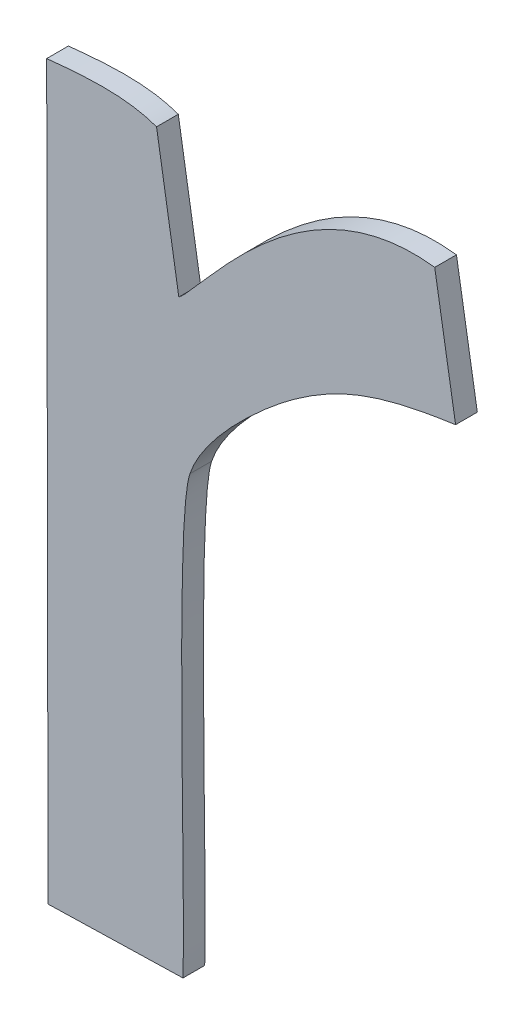
ISO-10303-21;
HEADER;
FILE_DESCRIPTION(('STEP AP214'),'2;1');
FILE_NAME('part.step','',(''),(''),'','','');
FILE_SCHEMA(('AUTOMOTIVE_DESIGN { 1 0 10303 214 1 1 1 1 }'));
ENDSEC;
DATA;
#1=APPLICATION_CONTEXT('core data for automotive mechanical design processes');
#2=APPLICATION_PROTOCOL_DEFINITION('international standard','automotive_design',2000,#1);
#3=PRODUCT_CONTEXT('',#1,'mechanical');
#4=PRODUCT('Part','Part','',(#3));
#5=PRODUCT_RELATED_PRODUCT_CATEGORY('part','',(#4));
#6=PRODUCT_DEFINITION_FORMATION('','',#4);
#7=PRODUCT_DEFINITION_CONTEXT('part definition',#1,'design');
#8=PRODUCT_DEFINITION('design','',#6,#7);
#9=PRODUCT_DEFINITION_SHAPE('','',#8);
#10=(LENGTH_UNIT() NAMED_UNIT(*) SI_UNIT(.MILLI.,.METRE.));
#11=(NAMED_UNIT(*) PLANE_ANGLE_UNIT() SI_UNIT($,.RADIAN.));
#12=(NAMED_UNIT(*) SI_UNIT($,.STERADIAN.) SOLID_ANGLE_UNIT());
#13=UNCERTAINTY_MEASURE_WITH_UNIT(LENGTH_MEASURE(1.E-05),#10,'distance_accuracy_value','');
#14=(GEOMETRIC_REPRESENTATION_CONTEXT(3) GLOBAL_UNCERTAINTY_ASSIGNED_CONTEXT((#13)) GLOBAL_UNIT_ASSIGNED_CONTEXT((#10,
#11,#12)) REPRESENTATION_CONTEXT('',''));
#15=CARTESIAN_POINT('',(0.,0.,0.));
#16=DIRECTION('',(0.,0.,1.));
#17=DIRECTION('',(1.,0.,0.));
#18=AXIS2_PLACEMENT_3D('',#15,#16,#17);
#19=CARTESIAN_POINT('',(-9.5159382007321,-1.5536225633814,0.001));
#20=DIRECTION('',(-0.986932880775738,-0.161131898901808,0.));
#21=DIRECTION('',(0.161131898901808,-0.986932880775738,0.));
#22=AXIS2_PLACEMENT_3D('',#19,#20,#21);
#23=PLANE('',#22);
#24=DIRECTION('',(-0.161131898901808,0.986932880775738,0.));
#25=VECTOR('',#24,1.);
#26=CARTESIAN_POINT('',(-9.5159382007321,-1.5536225633814,0.));
#27=LINE('',#26,#25);
#28=CARTESIAN_POINT('',(-1.83305765625,-48.6112658984375,0.));
#29=VERTEX_POINT('',#28);
#30=CARTESIAN_POINT('',(-1.83408140625,-48.6049954296875,0.));
#31=VERTEX_POINT('',#30);
#32=EDGE_CURVE('E11',#29,#31,#27,.T.);
#33=ORIENTED_EDGE('',*,*,#32,.T.);
#34=DIRECTION('',(0.,0.,-1.));
#35=VECTOR('',#34,1.);
#36=CARTESIAN_POINT('',(-1.83408140625,-48.6049954296875,0.001));
#37=LINE('',#36,#35);
#38=CARTESIAN_POINT('',(-1.83408140625,-48.6049954296875,0.001));
#39=VERTEX_POINT('',#38);
#40=EDGE_CURVE('E24',#39,#31,#37,.T.);
#41=ORIENTED_EDGE('',*,*,#40,.F.);
#42=DIRECTION('',(-0.161131898901808,0.986932880775738,0.));
#43=VECTOR('',#42,1.);
#44=CARTESIAN_POINT('',(-9.5159382007321,-1.5536225633814,0.001));
#45=LINE('',#44,#43);
#46=CARTESIAN_POINT('',(-1.83305765625,-48.6112658984375,0.001));
#47=VERTEX_POINT('',#46);
#48=EDGE_CURVE('E205',#47,#39,#45,.T.);
#49=ORIENTED_EDGE('',*,*,#48,.F.);
#50=DIRECTION('',(0.,0.,-1.));
#51=VECTOR('',#50,1.);
#52=CARTESIAN_POINT('',(-1.83305765625,-48.6112658984375,0.001));
#53=LINE('',#52,#51);
#54=EDGE_CURVE('E106',#47,#29,#53,.T.);
#55=ORIENTED_EDGE('',*,*,#54,.T.);
#56=EDGE_LOOP('',(#33,#41,#49,#55));
#57=FACE_BOUND('',#56,.T.);
#58=ADVANCED_FACE('F17',(#57),#23,.F.);
#59=CARTESIAN_POINT('',(-1.83408140625,-48.6049954296875,0.001));
#60=CARTESIAN_POINT('',(-1.83408140625,-48.6049954296875,0.));
#61=CARTESIAN_POINT('',(-1.835553046875,-48.6044515625,0.001));
#62=CARTESIAN_POINT('',(-1.835553046875,-48.6044515625,0.));
#63=CARTESIAN_POINT('',(-1.8375365625,-48.604643515625,0.001));
#64=CARTESIAN_POINT('',(-1.8375365625,-48.604643515625,0.));
#65=CARTESIAN_POINT('',(-1.839136171875,-48.6048034765625,0.001));
#66=CARTESIAN_POINT('',(-1.839136171875,-48.6048034765625,0.));
#67=B_SPLINE_SURFACE_WITH_KNOTS('',3,1,((#59,#60),(#61,#62),(#63,#64),(#65,#66)),.UNSPECIFIED.,
.F.,.F.,.F.,(4,4),(2,2),(0.6,0.7),(0.,1.),.UNSPECIFIED.);
#68=CARTESIAN_POINT('',(-1.83408140625,-48.6049954296875,0.));
#69=CARTESIAN_POINT('',(-1.835553046875,-48.6044515625,0.));
#70=CARTESIAN_POINT('',(-1.8375365625,-48.604643515625,0.));
#71=CARTESIAN_POINT('',(-1.839136171875,-48.6048034765625,0.));
#72=B_SPLINE_CURVE_WITH_KNOTS('',3,(#68,#69,#70,#71),.UNSPECIFIED.,.F.,.F.,(4,4),(0.6,0.7),.UNSPECIFIED.);
#73=CARTESIAN_POINT('',(-1.839136171875,-48.6048034765625,0.));
#74=VERTEX_POINT('',#73);
#75=EDGE_CURVE('E196',#31,#74,#72,.T.);
#76=DIRECTION('',(0.,0.,-1.));
#77=VECTOR('',#76,1.);
#78=CARTESIAN_POINT('',(-1.839136171875,-48.6048034765625,0.001));
#79=LINE('',#78,#77);
#80=CARTESIAN_POINT('',(-1.839136171875,-48.6048034765625,0.001));
#81=VERTEX_POINT('',#80);
#82=EDGE_CURVE('E191',#81,#74,#79,.T.);
#83=CARTESIAN_POINT('',(-1.83408140625,-48.6049954296875,0.001));
#84=CARTESIAN_POINT('',(-1.835553046875,-48.6044515625,0.001));
#85=CARTESIAN_POINT('',(-1.8375365625,-48.604643515625,0.001));
#86=CARTESIAN_POINT('',(-1.839136171875,-48.6048034765625,0.001));
#87=B_SPLINE_CURVE_WITH_KNOTS('',3,(#83,#84,#85,#86),.UNSPECIFIED.,.F.,.F.,(4,4),(0.6,0.7),.UNSPECIFIED.);
#88=EDGE_CURVE('E187',#39,#81,#87,.T.);
#89=ORIENTED_EDGE('',*,*,#75,.T.);
#90=ORIENTED_EDGE('',*,*,#82,.F.);
#91=ORIENTED_EDGE('',*,*,#88,.F.);
#92=ORIENTED_EDGE('',*,*,#40,.T.);
#93=EDGE_LOOP('',(#89,#90,#91,#92));
#94=FACE_BOUND('',#93,.T.);
#95=ADVANCED_FACE('F208',(#94),#67,.F.);
#96=CARTESIAN_POINT('',(-1.9315337600102,-0.00367211741446376,0.001));
#97=DIRECTION('',(0.999998192836948,0.0019011372487373,0.));
#98=DIRECTION('',(-0.0019011372487373,0.999998192836948,0.));
#99=AXIS2_PLACEMENT_3D('',#96,#97,#98);
#100=PLANE('',#99);
#101=DIRECTION('',(0.0019011372487373,-0.999998192836948,0.));
#102=VECTOR('',#101,1.);
#103=CARTESIAN_POINT('',(-1.9315337600102,-0.00367211741446376,0.));
#104=LINE('',#103,#102);
#105=CARTESIAN_POINT('',(-1.8390721875,-48.6384592578125,0.));
#106=VERTEX_POINT('',#105);
#107=EDGE_CURVE('E185',#74,#106,#104,.T.);
#108=ORIENTED_EDGE('',*,*,#107,.T.);
#109=DIRECTION('',(0.,0.,-1.));
#110=VECTOR('',#109,1.);
#111=CARTESIAN_POINT('',(-1.8390721875,-48.6384592578125,0.001));
#112=LINE('',#111,#110);
#113=CARTESIAN_POINT('',(-1.8390721875,-48.6384592578125,0.001));
#114=VERTEX_POINT('',#113);
#115=EDGE_CURVE('E182',#114,#106,#112,.T.);
#116=ORIENTED_EDGE('',*,*,#115,.F.);
#117=DIRECTION('',(0.0019011372487373,-0.999998192836948,0.));
#118=VECTOR('',#117,1.);
#119=CARTESIAN_POINT('',(-1.9315337600102,-0.00367211741446376,0.001));
#120=LINE('',#119,#118);
#121=EDGE_CURVE('E179',#81,#114,#120,.T.);
#122=ORIENTED_EDGE('',*,*,#121,.F.);
#123=ORIENTED_EDGE('',*,*,#82,.T.);
#124=EDGE_LOOP('',(#108,#116,#122,#123));
#125=FACE_BOUND('',#124,.T.);
#126=ADVANCED_FACE('F215',(#125),#100,.F.);
#127=CARTESIAN_POINT('',(1.2515155910401,-48.5588049336254,0.001));
#128=DIRECTION('',(-0.0257646401168516,0.999668036559962,0.));
#129=DIRECTION('',(-0.999668036559962,-0.0257646401168516,0.));
#130=AXIS2_PLACEMENT_3D('',#127,#128,#129);
#131=PLANE('',#130);
#132=DIRECTION('',(0.999668036559962,0.0257646401168516,0.));
#133=VECTOR('',#132,1.);
#134=CARTESIAN_POINT('',(1.2515155910401,-48.5588049336254,0.));
#135=LINE('',#134,#133);
#136=CARTESIAN_POINT('',(-1.832865703125,-48.638299296875,0.));
#137=VERTEX_POINT('',#136);
#138=EDGE_CURVE('E177',#106,#137,#135,.T.);
#139=ORIENTED_EDGE('',*,*,#138,.T.);
#140=DIRECTION('',(0.,0.,-1.));
#141=VECTOR('',#140,1.);
#142=CARTESIAN_POINT('',(-1.832865703125,-48.638299296875,0.001));
#143=LINE('',#142,#141);
#144=CARTESIAN_POINT('',(-1.832865703125,-48.638299296875,0.001));
#145=VERTEX_POINT('',#144);
#146=EDGE_CURVE('E174',#145,#137,#143,.T.);
#147=ORIENTED_EDGE('',*,*,#146,.F.);
#148=DIRECTION('',(0.999668036559962,0.0257646401168516,0.));
#149=VECTOR('',#148,1.);
#150=CARTESIAN_POINT('',(1.2515155910401,-48.5588049336254,0.001));
#151=LINE('',#150,#149);
#152=EDGE_CURVE('E168',#114,#145,#151,.T.);
#153=ORIENTED_EDGE('',*,*,#152,.F.);
#154=ORIENTED_EDGE('',*,*,#115,.T.);
#155=EDGE_LOOP('',(#139,#147,#153,#154));
#156=FACE_BOUND('',#155,.T.);
#157=ADVANCED_FACE('F219',(#156),#131,.F.);
#158=CARTESIAN_POINT('',(-1.832865703125,-48.638299296875,0.001));
#159=CARTESIAN_POINT('',(-1.832865703125,-48.638299296875,0.));
#160=CARTESIAN_POINT('',(-1.832737734375,-48.634844140625,0.001));
#161=CARTESIAN_POINT('',(-1.832737734375,-48.634844140625,0.));
#162=CARTESIAN_POINT('',(-1.833249609375,-48.6200317578125,0.001));
#163=CARTESIAN_POINT('',(-1.833249609375,-48.6200317578125,0.));
#164=CARTESIAN_POINT('',(-1.83254578125,-48.6180482421875,0.001));
#165=CARTESIAN_POINT('',(-1.83254578125,-48.6180482421875,0.));
#166=B_SPLINE_SURFACE_WITH_KNOTS('',3,1,((#158,#159),(#160,#161),(#162,#163),(#164,#165)),
.UNSPECIFIED.,.F.,.F.,.F.,(4,4),(2,2),(0.,0.1),(0.,1.),.UNSPECIFIED.);
#167=CARTESIAN_POINT('',(-1.832865703125,-48.638299296875,0.));
#168=CARTESIAN_POINT('',(-1.832737734375,-48.634844140625,0.));
#169=CARTESIAN_POINT('',(-1.833249609375,-48.6200317578125,0.));
#170=CARTESIAN_POINT('',(-1.83254578125,-48.6180482421875,0.));
#171=B_SPLINE_CURVE_WITH_KNOTS('',3,(#167,#168,#169,#170),.UNSPECIFIED.,.F.,.F.,(4,4),(0.,0.1),.UNSPECIFIED.);
#172=CARTESIAN_POINT('',(-1.83254578125,-48.6180482421875,0.));
#173=VERTEX_POINT('',#172);
#174=EDGE_CURVE('E163',#137,#173,#171,.T.);
#175=DIRECTION('',(0.,0.,-1.));
#176=VECTOR('',#175,1.);
#177=CARTESIAN_POINT('',(-1.83254578125,-48.6180482421875,0.001));
#178=LINE('',#177,#176);
#179=CARTESIAN_POINT('',(-1.83254578125,-48.6180482421875,0.001));
#180=VERTEX_POINT('',#179);
#181=EDGE_CURVE('E158',#180,#173,#178,.T.);
#182=CARTESIAN_POINT('',(-1.832865703125,-48.638299296875,0.001));
#183=CARTESIAN_POINT('',(-1.832737734375,-48.634844140625,0.001));
#184=CARTESIAN_POINT('',(-1.833249609375,-48.6200317578125,0.001));
#185=CARTESIAN_POINT('',(-1.83254578125,-48.6180482421875,0.001));
#186=B_SPLINE_CURVE_WITH_KNOTS('',3,(#182,#183,#184,#185),.UNSPECIFIED.,.F.,.F.,(4,4),(0.,0.1),.UNSPECIFIED.);
#187=EDGE_CURVE('E151',#145,#180,#186,.T.);
#188=ORIENTED_EDGE('',*,*,#174,.T.);
#189=ORIENTED_EDGE('',*,*,#181,.F.);
#190=ORIENTED_EDGE('',*,*,#187,.F.);
#191=ORIENTED_EDGE('',*,*,#146,.T.);
#192=EDGE_LOOP('',(#188,#189,#190,#191));
#193=FACE_BOUND('',#192,.T.);
#194=ADVANCED_FACE('F223',(#193),#166,.F.);
#195=CARTESIAN_POINT('',(-1.83254578125,-48.6180482421875,0.001));
#196=CARTESIAN_POINT('',(-1.83254578125,-48.6180482421875,0.));
#197=CARTESIAN_POINT('',(-1.8319059375,-48.6161287109375,0.001));
#198=CARTESIAN_POINT('',(-1.8319059375,-48.6161287109375,0.));
#199=CARTESIAN_POINT('',(-1.829154609375,-48.6136973046875,0.001));
#200=CARTESIAN_POINT('',(-1.829154609375,-48.6136973046875,0.));
#201=CARTESIAN_POINT('',(-1.8277789453125,-48.612705546875,0.001));
#202=CARTESIAN_POINT('',(-1.8277789453125,-48.612705546875,0.));
#203=B_SPLINE_SURFACE_WITH_KNOTS('',3,1,((#195,#196),(#197,#198),(#199,#200),(#201,#202)),
.UNSPECIFIED.,.F.,.F.,.F.,(4,4),(2,2),(0.1,0.2),(0.,1.),.UNSPECIFIED.);
#204=CARTESIAN_POINT('',(-1.83254578125,-48.6180482421875,0.));
#205=CARTESIAN_POINT('',(-1.8319059375,-48.6161287109375,0.));
#206=CARTESIAN_POINT('',(-1.829154609375,-48.6136973046875,0.));
#207=CARTESIAN_POINT('',(-1.8277789453125,-48.612705546875,0.));
#208=B_SPLINE_CURVE_WITH_KNOTS('',3,(#204,#205,#206,#207),.UNSPECIFIED.,.F.,.F.,(4,4),(0.1,0.2),.UNSPECIFIED.);
#209=CARTESIAN_POINT('',(-1.8277789453125,-48.612705546875,0.));
#210=VERTEX_POINT('',#209);
#211=EDGE_CURVE('E146',#173,#210,#208,.T.);
#212=DIRECTION('',(0.,0.,-1.));
#213=VECTOR('',#212,1.);
#214=CARTESIAN_POINT('',(-1.8277789453125,-48.612705546875,0.001));
#215=LINE('',#214,#213);
#216=CARTESIAN_POINT('',(-1.8277789453125,-48.612705546875,0.001));
#217=VERTEX_POINT('',#216);
#218=EDGE_CURVE('E141',#217,#210,#215,.T.);
#219=CARTESIAN_POINT('',(-1.83254578125,-48.6180482421875,0.001));
#220=CARTESIAN_POINT('',(-1.8319059375,-48.6161287109375,0.001));
#221=CARTESIAN_POINT('',(-1.829154609375,-48.6136973046875,0.001));
#222=CARTESIAN_POINT('',(-1.8277789453125,-48.612705546875,0.001));
#223=B_SPLINE_CURVE_WITH_KNOTS('',3,(#219,#220,#221,#222),.UNSPECIFIED.,.F.,.F.,(4,4),(0.1,0.2),.UNSPECIFIED.);
#224=EDGE_CURVE('E134',#180,#217,#223,.T.);
#225=ORIENTED_EDGE('',*,*,#211,.T.);
#226=ORIENTED_EDGE('',*,*,#218,.F.);
#227=ORIENTED_EDGE('',*,*,#224,.F.);
#228=ORIENTED_EDGE('',*,*,#181,.T.);
#229=EDGE_LOOP('',(#225,#226,#227,#228));
#230=FACE_BOUND('',#229,.T.);
#231=ADVANCED_FACE('F228',(#230),#203,.F.);
#232=CARTESIAN_POINT('',(-1.8277789453125,-48.612705546875,0.001));
#233=CARTESIAN_POINT('',(-1.8277789453125,-48.612705546875,0.));
#234=CARTESIAN_POINT('',(-1.8256034765625,-48.6111379296875,0.001));
#235=CARTESIAN_POINT('',(-1.8256034765625,-48.6111379296875,0.));
#236=CARTESIAN_POINT('',(-1.8237159375,-48.61046609375,0.001));
#237=CARTESIAN_POINT('',(-1.8237159375,-48.61046609375,0.));
#238=CARTESIAN_POINT('',(-1.820324765625,-48.6099862109375,0.001));
#239=CARTESIAN_POINT('',(-1.820324765625,-48.6099862109375,0.));
#240=B_SPLINE_SURFACE_WITH_KNOTS('',3,1,((#232,#233),(#234,#235),(#236,#237),(#238,#239)),
.UNSPECIFIED.,.F.,.F.,.F.,(4,4),(2,2),(0.2,0.3),(0.,1.),.UNSPECIFIED.);
#241=CARTESIAN_POINT('',(-1.8277789453125,-48.612705546875,0.));
#242=CARTESIAN_POINT('',(-1.8256034765625,-48.6111379296875,0.));
#243=CARTESIAN_POINT('',(-1.8237159375,-48.61046609375,0.));
#244=CARTESIAN_POINT('',(-1.820324765625,-48.6099862109375,0.));
#245=B_SPLINE_CURVE_WITH_KNOTS('',3,(#241,#242,#243,#244),.UNSPECIFIED.,.F.,.F.,(4,4),(0.2,0.3),.UNSPECIFIED.);
#246=CARTESIAN_POINT('',(-1.820324765625,-48.6099862109375,0.));
#247=VERTEX_POINT('',#246);
#248=EDGE_CURVE('E129',#210,#247,#245,.T.);
#249=DIRECTION('',(0.,0.,-1.));
#250=VECTOR('',#249,1.);
#251=CARTESIAN_POINT('',(-1.820324765625,-48.6099862109375,0.001));
#252=LINE('',#251,#250);
#253=CARTESIAN_POINT('',(-1.820324765625,-48.6099862109375,0.001));
#254=VERTEX_POINT('',#253);
#255=EDGE_CURVE('E124',#254,#247,#252,.T.);
#256=CARTESIAN_POINT('',(-1.8277789453125,-48.612705546875,0.001));
#257=CARTESIAN_POINT('',(-1.8256034765625,-48.6111379296875,0.001));
#258=CARTESIAN_POINT('',(-1.8237159375,-48.61046609375,0.001));
#259=CARTESIAN_POINT('',(-1.820324765625,-48.6099862109375,0.001));
#260=B_SPLINE_CURVE_WITH_KNOTS('',3,(#256,#257,#258,#259),.UNSPECIFIED.,.F.,.F.,(4,4),(0.2,0.3),.UNSPECIFIED.);
#261=EDGE_CURVE('E100',#217,#254,#260,.T.);
#262=ORIENTED_EDGE('',*,*,#248,.T.);
#263=ORIENTED_EDGE('',*,*,#255,.F.);
#264=ORIENTED_EDGE('',*,*,#261,.F.);
#265=ORIENTED_EDGE('',*,*,#218,.T.);
#266=EDGE_LOOP('',(#262,#263,#264,#265));
#267=FACE_BOUND('',#266,.T.);
#268=ADVANCED_FACE('F231',(#267),#240,.F.);
#269=CARTESIAN_POINT('',(-9.6131393830474,-1.5933380192943,0.001));
#270=DIRECTION('',(-0.986540838696591,-0.163515056138038,0.));
#271=DIRECTION('',(0.163515056138038,-0.986540838696591,0.));
#272=AXIS2_PLACEMENT_3D('',#269,#270,#271);
#273=PLANE('',#272);
#274=DIRECTION('',(-0.163515056138038,0.986540838696591,0.));
#275=VECTOR('',#274,1.);
#276=CARTESIAN_POINT('',(-9.6131393830474,-1.5933380192943,0.));
#277=LINE('',#276,#275);
#278=CARTESIAN_POINT('',(-1.82128453125,-48.604195625,0.));
#279=VERTEX_POINT('',#278);
#280=EDGE_CURVE('E89',#247,#279,#277,.T.);
#281=ORIENTED_EDGE('',*,*,#280,.T.);
#282=DIRECTION('',(0.,0.,-1.));
#283=VECTOR('',#282,1.);
#284=CARTESIAN_POINT('',(-1.82128453125,-48.604195625,0.001));
#285=LINE('',#284,#283);
#286=CARTESIAN_POINT('',(-1.82128453125,-48.604195625,0.001));
#287=VERTEX_POINT('',#286);
#288=EDGE_CURVE('E84',#287,#279,#285,.T.);
#289=ORIENTED_EDGE('',*,*,#288,.F.);
#290=DIRECTION('',(-0.163515056138038,0.986540838696591,0.));
#291=VECTOR('',#290,1.);
#292=CARTESIAN_POINT('',(-9.6131393830474,-1.5933380192943,0.001));
#293=LINE('',#292,#291);
#294=EDGE_CURVE('E87',#254,#287,#293,.T.);
#295=ORIENTED_EDGE('',*,*,#294,.F.);
#296=ORIENTED_EDGE('',*,*,#255,.T.);
#297=EDGE_LOOP('',(#281,#289,#295,#296));
#298=FACE_BOUND('',#297,.T.);
#299=ADVANCED_FACE('F86',(#298),#273,.F.);
#300=CARTESIAN_POINT('',(-1.82128453125,-48.604195625,0.001));
#301=CARTESIAN_POINT('',(-1.82128453125,-48.604195625,0.));
#302=CARTESIAN_POINT('',(-1.8274590234375,-48.6034278125,0.001));
#303=CARTESIAN_POINT('',(-1.8274590234375,-48.6034278125,0.));
#304=CARTESIAN_POINT('',(-1.831841953125,-48.6103061328125,0.001));
#305=CARTESIAN_POINT('',(-1.831841953125,-48.6103061328125,0.));
#306=CARTESIAN_POINT('',(-1.83305765625,-48.6112658984375,0.001));
#307=CARTESIAN_POINT('',(-1.83305765625,-48.6112658984375,0.));
#308=B_SPLINE_SURFACE_WITH_KNOTS('',3,1,((#300,#301),(#302,#303),(#304,#305),(#306,#307)),
.UNSPECIFIED.,.F.,.F.,.F.,(4,4),(2,2),(0.4,0.5),(0.,1.),.UNSPECIFIED.);
#309=CARTESIAN_POINT('',(-1.82128453125,-48.604195625,0.));
#310=CARTESIAN_POINT('',(-1.8274590234375,-48.6034278125,0.));
#311=CARTESIAN_POINT('',(-1.831841953125,-48.6103061328125,0.));
#312=CARTESIAN_POINT('',(-1.83305765625,-48.6112658984375,0.));
#313=B_SPLINE_CURVE_WITH_KNOTS('',3,(#309,#310,#311,#312),.UNSPECIFIED.,.F.,.F.,(4,4),(0.4,0.5),.UNSPECIFIED.);
#314=EDGE_CURVE('E102',#279,#29,#313,.T.);
#315=CARTESIAN_POINT('',(-1.82128453125,-48.604195625,0.001));
#316=CARTESIAN_POINT('',(-1.8274590234375,-48.6034278125,0.001));
#317=CARTESIAN_POINT('',(-1.831841953125,-48.6103061328125,0.001));
#318=CARTESIAN_POINT('',(-1.83305765625,-48.6112658984375,0.001));
#319=B_SPLINE_CURVE_WITH_KNOTS('',3,(#315,#316,#317,#318),.UNSPECIFIED.,.F.,.F.,(4,4),(0.4,0.5),.UNSPECIFIED.);
#320=EDGE_CURVE('E98',#287,#47,#319,.T.);
#321=ORIENTED_EDGE('',*,*,#314,.T.);
#322=ORIENTED_EDGE('',*,*,#54,.F.);
#323=ORIENTED_EDGE('',*,*,#320,.F.);
#324=ORIENTED_EDGE('',*,*,#288,.T.);
#325=EDGE_LOOP('',(#321,#322,#323,#324));
#326=FACE_BOUND('',#325,.T.);
#327=ADVANCED_FACE('F105',(#326),#308,.F.);
#328=CARTESIAN_POINT('',(0.,0.,0.001));
#329=DIRECTION('',(0.,0.,1.));
#330=DIRECTION('',(1.,0.,0.));
#331=AXIS2_PLACEMENT_3D('',#328,#329,#330);
#332=PLANE('',#331);
#333=ORIENTED_EDGE('',*,*,#48,.T.);
#334=ORIENTED_EDGE('',*,*,#88,.T.);
#335=ORIENTED_EDGE('',*,*,#121,.T.);
#336=ORIENTED_EDGE('',*,*,#152,.T.);
#337=ORIENTED_EDGE('',*,*,#187,.T.);
#338=ORIENTED_EDGE('',*,*,#224,.T.);
#339=ORIENTED_EDGE('',*,*,#261,.T.);
#340=ORIENTED_EDGE('',*,*,#294,.T.);
#341=ORIENTED_EDGE('',*,*,#320,.T.);
#342=EDGE_LOOP('',(#333,#334,#335,#336,#337,#338,#339,#340,#341));
#343=FACE_BOUND('',#342,.T.);
#344=ADVANCED_FACE('F97',(#343),#332,.T.);
#345=CARTESIAN_POINT('',(0.,0.,0.));
#346=DIRECTION('',(0.,0.,1.));
#347=DIRECTION('',(1.,0.,0.));
#348=AXIS2_PLACEMENT_3D('',#345,#346,#347);
#349=PLANE('',#348);
#350=ORIENTED_EDGE('',*,*,#32,.F.);
#351=ORIENTED_EDGE('',*,*,#314,.F.);
#352=ORIENTED_EDGE('',*,*,#280,.F.);
#353=ORIENTED_EDGE('',*,*,#248,.F.);
#354=ORIENTED_EDGE('',*,*,#211,.F.);
#355=ORIENTED_EDGE('',*,*,#174,.F.);
#356=ORIENTED_EDGE('',*,*,#138,.F.);
#357=ORIENTED_EDGE('',*,*,#107,.F.);
#358=ORIENTED_EDGE('',*,*,#75,.F.);
#359=EDGE_LOOP('',(#350,#351,#352,#353,#354,#355,#356,#357,#358));
#360=FACE_BOUND('',#359,.T.);
#361=ADVANCED_FACE('F211',(#360),#349,.F.);
#362=CLOSED_SHELL('',(#58,#95,#126,#157,#194,#231,#268,#299,#327,#344,#361));
#363=MANIFOLD_SOLID_BREP('B1',#362);
#364=ADVANCED_BREP_SHAPE_REPRESENTATION('',(#18,#363),#14);
#365=SHAPE_DEFINITION_REPRESENTATION(#9,#364);
ENDSEC;
END-ISO-10303-21;
